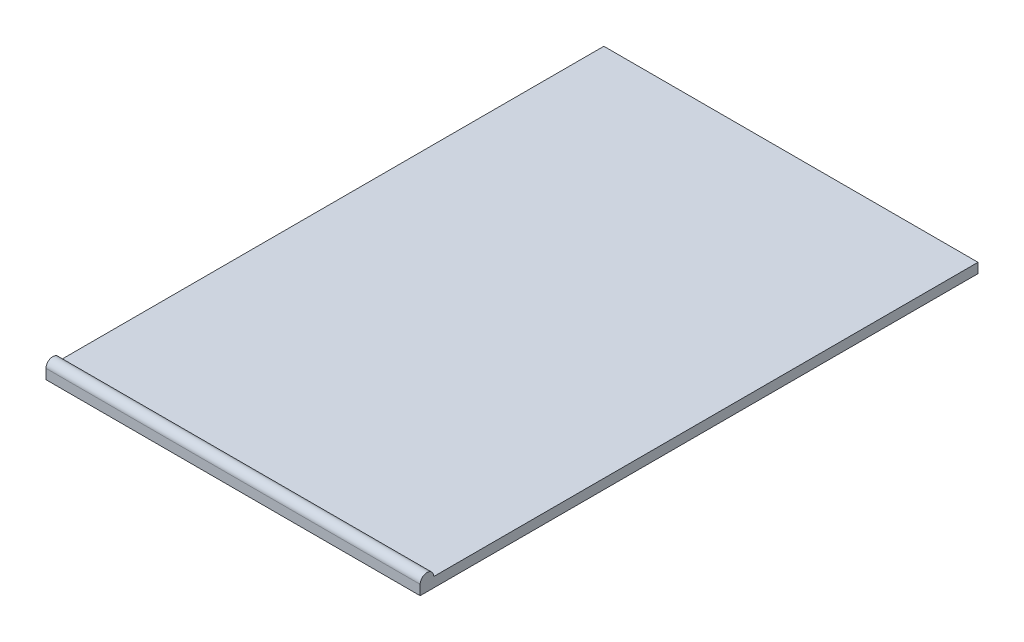
ISO-10303-21;
HEADER;
FILE_DESCRIPTION(('STEP AP214'),'2;1');
FILE_NAME('part.step','',(''),(''),'','','');
FILE_SCHEMA(('AUTOMOTIVE_DESIGN { 1 0 10303 214 1 1 1 1 }'));
ENDSEC;
DATA;
#1=APPLICATION_CONTEXT('core data for automotive mechanical design processes');
#2=APPLICATION_PROTOCOL_DEFINITION('international standard','automotive_design',2000,#1);
#3=PRODUCT_CONTEXT('',#1,'mechanical');
#4=PRODUCT('Part','Part','',(#3));
#5=PRODUCT_RELATED_PRODUCT_CATEGORY('part','',(#4));
#6=PRODUCT_DEFINITION_FORMATION('','',#4);
#7=PRODUCT_DEFINITION_CONTEXT('part definition',#1,'design');
#8=PRODUCT_DEFINITION('design','',#6,#7);
#9=PRODUCT_DEFINITION_SHAPE('','',#8);
#10=(LENGTH_UNIT() NAMED_UNIT(*) SI_UNIT(.MILLI.,.METRE.));
#11=(NAMED_UNIT(*) PLANE_ANGLE_UNIT() SI_UNIT($,.RADIAN.));
#12=(NAMED_UNIT(*) SI_UNIT($,.STERADIAN.) SOLID_ANGLE_UNIT());
#13=UNCERTAINTY_MEASURE_WITH_UNIT(LENGTH_MEASURE(1.E-05),#10,'distance_accuracy_value','');
#14=(GEOMETRIC_REPRESENTATION_CONTEXT(3) GLOBAL_UNCERTAINTY_ASSIGNED_CONTEXT((#13)) GLOBAL_UNIT_ASSIGNED_CONTEXT((#10,
#11,#12)) REPRESENTATION_CONTEXT('',''));
#15=CARTESIAN_POINT('',(0.,0.,0.));
#16=DIRECTION('',(0.,0.,1.));
#17=DIRECTION('',(1.,0.,0.));
#18=AXIS2_PLACEMENT_3D('',#15,#16,#17);
#19=CARTESIAN_POINT('',(0.,2.9,0.));
#20=DIRECTION('',(0.,1.,0.));
#21=DIRECTION('',(0.,0.,1.));
#22=AXIS2_PLACEMENT_3D('',#19,#20,#21);
#23=PLANE('',#22);
#24=DIRECTION('',(0.,0.,1.));
#25=VECTOR('',#24,1.);
#26=CARTESIAN_POINT('',(0.,2.9,0.));
#27=LINE('',#26,#25);
#28=CARTESIAN_POINT('',(0.,2.9,0.));
#29=VERTEX_POINT('',#28);
#30=CARTESIAN_POINT('',(0.,2.9,160.));
#31=VERTEX_POINT('',#30);
#32=EDGE_CURVE('E55',#29,#31,#27,.T.);
#33=ORIENTED_EDGE('',*,*,#32,.T.);
#34=DIRECTION('',(1.,0.,0.));
#35=VECTOR('',#34,1.);
#36=CARTESIAN_POINT('',(0.,2.89999999999999,160.));
#37=LINE('',#36,#35);
#38=CARTESIAN_POINT('',(110.,2.89999999999999,160.));
#39=VERTEX_POINT('',#38);
#40=EDGE_CURVE('E100',#31,#39,#37,.T.);
#41=ORIENTED_EDGE('',*,*,#40,.T.);
#42=DIRECTION('',(0.,0.,-1.));
#43=VECTOR('',#42,1.);
#44=CARTESIAN_POINT('',(110.,2.9,164.));
#45=LINE('',#44,#43);
#46=CARTESIAN_POINT('',(110.,2.9,0.));
#47=VERTEX_POINT('',#46);
#48=EDGE_CURVE('E61',#39,#47,#45,.T.);
#49=ORIENTED_EDGE('',*,*,#48,.T.);
#50=DIRECTION('',(-1.,0.,0.));
#51=VECTOR('',#50,1.);
#52=CARTESIAN_POINT('',(110.,2.9,0.));
#53=LINE('',#52,#51);
#54=EDGE_CURVE('E114',#47,#29,#53,.T.);
#55=ORIENTED_EDGE('',*,*,#54,.T.);
#56=EDGE_LOOP('',(#33,#41,#49,#55));
#57=FACE_BOUND('',#56,.T.);
#58=ADVANCED_FACE('F39',(#57),#23,.T.);
#59=CARTESIAN_POINT('',(110.,2.9,0.));
#60=DIRECTION('',(0.,0.,1.));
#61=DIRECTION('',(1.,0.,0.));
#62=AXIS2_PLACEMENT_3D('',#59,#60,#61);
#63=PLANE('',#62);
#64=DIRECTION('',(-1.,0.,0.));
#65=VECTOR('',#64,1.);
#66=CARTESIAN_POINT('',(110.,0.,0.));
#67=LINE('',#66,#65);
#68=CARTESIAN_POINT('',(110.,0.,0.));
#69=VERTEX_POINT('',#68);
#70=CARTESIAN_POINT('',(0.,0.,0.));
#71=VERTEX_POINT('',#70);
#72=EDGE_CURVE('E111',#69,#71,#67,.T.);
#73=ORIENTED_EDGE('',*,*,#72,.T.);
#74=DIRECTION('',(0.,-1.,0.));
#75=VECTOR('',#74,1.);
#76=CARTESIAN_POINT('',(0.,2.9,0.));
#77=LINE('',#76,#75);
#78=EDGE_CURVE('E11',#29,#71,#77,.T.);
#79=ORIENTED_EDGE('',*,*,#78,.F.);
#80=ORIENTED_EDGE('',*,*,#54,.F.);
#81=DIRECTION('',(0.,-1.,0.));
#82=VECTOR('',#81,1.);
#83=CARTESIAN_POINT('',(110.,2.9,0.));
#84=LINE('',#83,#82);
#85=EDGE_CURVE('E94',#47,#69,#84,.T.);
#86=ORIENTED_EDGE('',*,*,#85,.T.);
#87=EDGE_LOOP('',(#73,#79,#80,#86));
#88=FACE_BOUND('',#87,.T.);
#89=ADVANCED_FACE('F41',(#88),#63,.F.);
#90=CARTESIAN_POINT('',(0.,2.9,0.));
#91=DIRECTION('',(1.,0.,0.));
#92=DIRECTION('',(0.,0.,-1.));
#93=AXIS2_PLACEMENT_3D('',#90,#91,#92);
#94=PLANE('',#93);
#95=DIRECTION('',(0.,0.,1.));
#96=VECTOR('',#95,1.);
#97=CARTESIAN_POINT('',(0.,0.,0.));
#98=LINE('',#97,#96);
#99=CARTESIAN_POINT('',(0.,0.,164.));
#100=VERTEX_POINT('',#99);
#101=EDGE_CURVE('E124',#71,#100,#98,.T.);
#102=ORIENTED_EDGE('',*,*,#101,.T.);
#103=DIRECTION('',(0.,-1.,0.));
#104=VECTOR('',#103,1.);
#105=CARTESIAN_POINT('',(0.,2.9,164.));
#106=LINE('',#105,#104);
#107=CARTESIAN_POINT('',(0.,2.9,164.));
#108=VERTEX_POINT('',#107);
#109=EDGE_CURVE('E48',#108,#100,#106,.T.);
#110=ORIENTED_EDGE('',*,*,#109,.F.);
#111=CARTESIAN_POINT('',(0.,2.9,162.));
#112=DIRECTION('',(1.,0.,0.));
#113=DIRECTION('',(0.,0.,-1.));
#114=AXIS2_PLACEMENT_3D('',#111,#112,#113);
#115=CIRCLE('',#114,2.);
#116=EDGE_CURVE('E108',#31,#108,#115,.T.);
#117=ORIENTED_EDGE('',*,*,#116,.F.);
#118=ORIENTED_EDGE('',*,*,#32,.F.);
#119=ORIENTED_EDGE('',*,*,#78,.T.);
#120=EDGE_LOOP('',(#102,#110,#117,#118,#119));
#121=FACE_BOUND('',#120,.T.);
#122=ADVANCED_FACE('F146',(#121),#94,.F.);
#123=CARTESIAN_POINT('',(0.,2.9,164.));
#124=DIRECTION('',(0.,0.,-1.));
#125=DIRECTION('',(-1.,0.,0.));
#126=AXIS2_PLACEMENT_3D('',#123,#124,#125);
#127=PLANE('',#126);
#128=DIRECTION('',(1.,0.,0.));
#129=VECTOR('',#128,1.);
#130=CARTESIAN_POINT('',(0.,0.,164.));
#131=LINE('',#130,#129);
#132=CARTESIAN_POINT('',(110.,0.,164.));
#133=VERTEX_POINT('',#132);
#134=EDGE_CURVE('E127',#100,#133,#131,.T.);
#135=ORIENTED_EDGE('',*,*,#134,.T.);
#136=DIRECTION('',(0.,-1.,0.));
#137=VECTOR('',#136,1.);
#138=CARTESIAN_POINT('',(110.,2.9,164.));
#139=LINE('',#138,#137);
#140=CARTESIAN_POINT('',(110.,2.9,164.));
#141=VERTEX_POINT('',#140);
#142=EDGE_CURVE('E134',#141,#133,#139,.T.);
#143=ORIENTED_EDGE('',*,*,#142,.F.);
#144=DIRECTION('',(1.,0.,0.));
#145=VECTOR('',#144,1.);
#146=CARTESIAN_POINT('',(0.,2.9,164.));
#147=LINE('',#146,#145);
#148=EDGE_CURVE('E97',#108,#141,#147,.T.);
#149=ORIENTED_EDGE('',*,*,#148,.F.);
#150=ORIENTED_EDGE('',*,*,#109,.T.);
#151=EDGE_LOOP('',(#135,#143,#149,#150));
#152=FACE_BOUND('',#151,.T.);
#153=ADVANCED_FACE('F140',(#152),#127,.F.);
#154=CARTESIAN_POINT('',(110.,2.9,164.));
#155=DIRECTION('',(-1.,0.,0.));
#156=DIRECTION('',(0.,0.,1.));
#157=AXIS2_PLACEMENT_3D('',#154,#155,#156);
#158=PLANE('',#157);
#159=DIRECTION('',(0.,0.,-1.));
#160=VECTOR('',#159,1.);
#161=CARTESIAN_POINT('',(110.,0.,164.));
#162=LINE('',#161,#160);
#163=EDGE_CURVE('E83',#133,#69,#162,.T.);
#164=ORIENTED_EDGE('',*,*,#163,.T.);
#165=ORIENTED_EDGE('',*,*,#85,.F.);
#166=ORIENTED_EDGE('',*,*,#48,.F.);
#167=CARTESIAN_POINT('',(110.,2.9,162.));
#168=DIRECTION('',(1.,0.,0.));
#169=DIRECTION('',(0.,0.,-1.));
#170=AXIS2_PLACEMENT_3D('',#167,#168,#169);
#171=CIRCLE('',#170,1.99999999999997);
#172=EDGE_CURVE('E92',#39,#141,#171,.T.);
#173=ORIENTED_EDGE('',*,*,#172,.T.);
#174=ORIENTED_EDGE('',*,*,#142,.T.);
#175=EDGE_LOOP('',(#164,#165,#166,#173,#174));
#176=FACE_BOUND('',#175,.T.);
#177=ADVANCED_FACE('F90',(#176),#158,.F.);
#178=CARTESIAN_POINT('',(0.,0.,0.));
#179=DIRECTION('',(0.,1.,0.));
#180=DIRECTION('',(0.,0.,1.));
#181=AXIS2_PLACEMENT_3D('',#178,#179,#180);
#182=PLANE('',#181);
#183=ORIENTED_EDGE('',*,*,#72,.F.);
#184=ORIENTED_EDGE('',*,*,#163,.F.);
#185=ORIENTED_EDGE('',*,*,#134,.F.);
#186=ORIENTED_EDGE('',*,*,#101,.F.);
#187=EDGE_LOOP('',(#183,#184,#185,#186));
#188=FACE_BOUND('',#187,.T.);
#189=ADVANCED_FACE('F143',(#188),#182,.F.);
#190=CARTESIAN_POINT('',(110.,2.9,162.));
#191=DIRECTION('',(1.,0.,0.));
#192=DIRECTION('',(0.,0.,-1.));
#193=AXIS2_PLACEMENT_3D('',#190,#191,#192);
#194=CYLINDRICAL_SURFACE('',#193,1.99999999999999);
#195=ORIENTED_EDGE('',*,*,#172,.F.);
#196=ORIENTED_EDGE('',*,*,#40,.F.);
#197=ORIENTED_EDGE('',*,*,#116,.T.);
#198=ORIENTED_EDGE('',*,*,#148,.T.);
#199=EDGE_LOOP('',(#195,#196,#197,#198));
#200=FACE_BOUND('',#199,.T.);
#201=ADVANCED_FACE('F105',(#200),#194,.T.);
#202=CLOSED_SHELL('',(#58,#89,#122,#153,#177,#189,#201));
#203=MANIFOLD_SOLID_BREP('B2',#202);
#204=ADVANCED_BREP_SHAPE_REPRESENTATION('',(#18,#203),#14);
#205=SHAPE_DEFINITION_REPRESENTATION(#9,#204);
ENDSEC;
END-ISO-10303-21;
